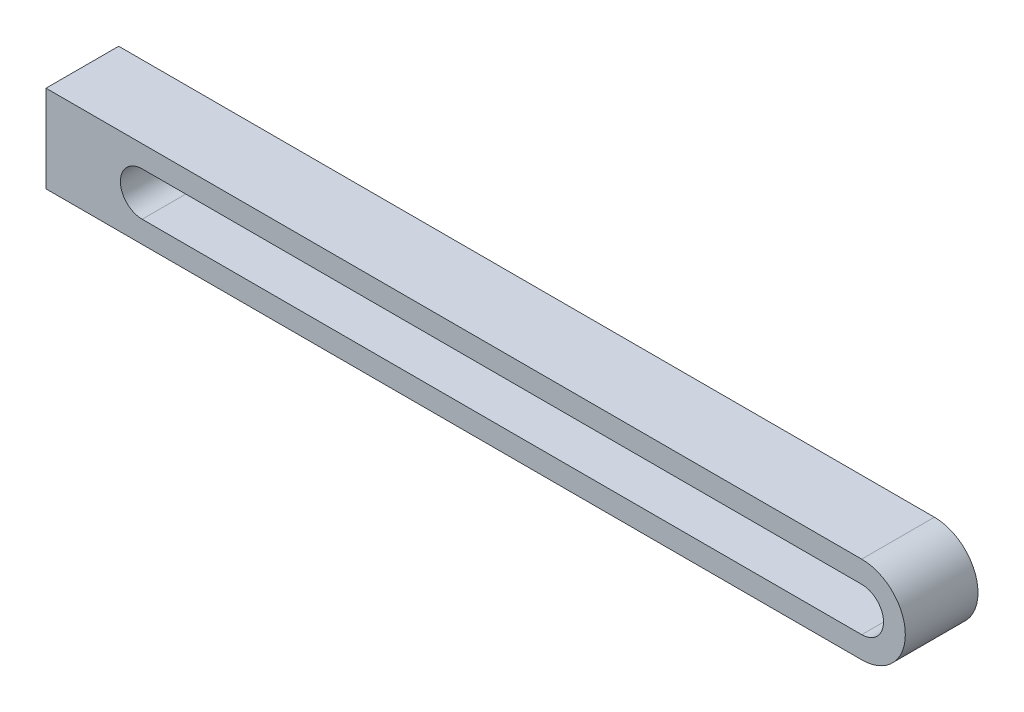
ISO-10303-21;
HEADER;
FILE_DESCRIPTION(('STEP AP214'),'2;1');
FILE_NAME('part.step','',(''),(''),'','','');
FILE_SCHEMA(('AUTOMOTIVE_DESIGN { 1 0 10303 214 1 1 1 1 }'));
ENDSEC;
DATA;
#1=APPLICATION_CONTEXT('core data for automotive mechanical design processes');
#2=APPLICATION_PROTOCOL_DEFINITION('international standard','automotive_design',2000,#1);
#3=PRODUCT_CONTEXT('',#1,'mechanical');
#4=PRODUCT('Part','Part','',(#3));
#5=PRODUCT_RELATED_PRODUCT_CATEGORY('part','',(#4));
#6=PRODUCT_DEFINITION_FORMATION('','',#4);
#7=PRODUCT_DEFINITION_CONTEXT('part definition',#1,'design');
#8=PRODUCT_DEFINITION('design','',#6,#7);
#9=PRODUCT_DEFINITION_SHAPE('','',#8);
#10=(LENGTH_UNIT() NAMED_UNIT(*) SI_UNIT(.MILLI.,.METRE.));
#11=(NAMED_UNIT(*) PLANE_ANGLE_UNIT() SI_UNIT($,.RADIAN.));
#12=(NAMED_UNIT(*) SI_UNIT($,.STERADIAN.) SOLID_ANGLE_UNIT());
#13=UNCERTAINTY_MEASURE_WITH_UNIT(LENGTH_MEASURE(1.E-05),#10,'distance_accuracy_value','');
#14=(GEOMETRIC_REPRESENTATION_CONTEXT(3) GLOBAL_UNCERTAINTY_ASSIGNED_CONTEXT((#13)) GLOBAL_UNIT_ASSIGNED_CONTEXT((#10,
#11,#12)) REPRESENTATION_CONTEXT('',''));
#15=CARTESIAN_POINT('',(0.,0.,0.));
#16=DIRECTION('',(0.,0.,1.));
#17=DIRECTION('',(1.,0.,0.));
#18=AXIS2_PLACEMENT_3D('',#15,#16,#17);
#19=CARTESIAN_POINT('',(49.5,0.,5.));
#20=DIRECTION('',(0.,0.,1.));
#21=DIRECTION('',(1.,0.,0.));
#22=AXIS2_PLACEMENT_3D('',#19,#20,#21);
#23=PLANE('',#22);
#24=DIRECTION('',(0.,-1.,0.));
#25=VECTOR('',#24,1.);
#26=CARTESIAN_POINT('',(-6.61682606522009,3.,5.));
#27=LINE('',#26,#25);
#28=CARTESIAN_POINT('',(-6.61682606522009,3.,5.));
#29=VERTEX_POINT('',#28);
#30=CARTESIAN_POINT('',(-6.61682606522009,-3.,5.));
#31=VERTEX_POINT('',#30);
#32=EDGE_CURVE('E159',#29,#31,#27,.T.);
#33=ORIENTED_EDGE('',*,*,#32,.T.);
#34=DIRECTION('',(1.,0.,0.));
#35=VECTOR('',#34,1.);
#36=CARTESIAN_POINT('',(3.,-3.,5.));
#37=LINE('',#36,#35);
#38=CARTESIAN_POINT('',(49.5,-3.,5.));
#39=VERTEX_POINT('',#38);
#40=EDGE_CURVE('E163',#31,#39,#37,.T.);
#41=ORIENTED_EDGE('',*,*,#40,.T.);
#42=CARTESIAN_POINT('',(49.5,0.,5.));
#43=DIRECTION('',(0.,0.,1.));
#44=DIRECTION('',(1.,0.,0.));
#45=AXIS2_PLACEMENT_3D('',#42,#43,#44);
#46=CIRCLE('',#45,3.);
#47=CARTESIAN_POINT('',(49.5,3.,5.));
#48=VERTEX_POINT('',#47);
#49=EDGE_CURVE('E167',#39,#48,#46,.T.);
#50=ORIENTED_EDGE('',*,*,#49,.T.);
#51=DIRECTION('',(-1.,0.,0.));
#52=VECTOR('',#51,1.);
#53=CARTESIAN_POINT('',(0.,3.,5.));
#54=LINE('',#53,#52);
#55=EDGE_CURVE('E170',#48,#29,#54,.T.);
#56=ORIENTED_EDGE('',*,*,#55,.T.);
#57=EDGE_LOOP('',(#33,#41,#50,#56));
#58=FACE_BOUND('',#57,.T.);
#59=DIRECTION('',(1.,0.,0.));
#60=VECTOR('',#59,1.);
#61=CARTESIAN_POINT('',(0.,-1.5,5.));
#62=LINE('',#61,#60);
#63=CARTESIAN_POINT('',(0.,-1.5,5.));
#64=VERTEX_POINT('',#63);
#65=CARTESIAN_POINT('',(49.5,-1.5,5.));
#66=VERTEX_POINT('',#65);
#67=EDGE_CURVE('E120',#64,#66,#62,.T.);
#68=ORIENTED_EDGE('',*,*,#67,.F.);
#69=CARTESIAN_POINT('',(0.,0.,5.));
#70=DIRECTION('',(0.,0.,1.));
#71=DIRECTION('',(1.,0.,0.));
#72=AXIS2_PLACEMENT_3D('',#69,#70,#71);
#73=CIRCLE('',#72,1.5);
#74=CARTESIAN_POINT('',(0.,1.5,5.));
#75=VERTEX_POINT('',#74);
#76=EDGE_CURVE('E111',#75,#64,#73,.T.);
#77=ORIENTED_EDGE('',*,*,#76,.F.);
#78=DIRECTION('',(-1.,0.,0.));
#79=VECTOR('',#78,1.);
#80=CARTESIAN_POINT('',(49.5,1.5,5.));
#81=LINE('',#80,#79);
#82=CARTESIAN_POINT('',(49.5,1.5,5.));
#83=VERTEX_POINT('',#82);
#84=EDGE_CURVE('E137',#83,#75,#81,.T.);
#85=ORIENTED_EDGE('',*,*,#84,.F.);
#86=CARTESIAN_POINT('',(49.5,0.,5.));
#87=DIRECTION('',(0.,0.,1.));
#88=DIRECTION('',(1.,0.,0.));
#89=AXIS2_PLACEMENT_3D('',#86,#87,#88);
#90=CIRCLE('',#89,1.5);
#91=EDGE_CURVE('E133',#66,#83,#90,.T.);
#92=ORIENTED_EDGE('',*,*,#91,.F.);
#93=EDGE_LOOP('',(#68,#77,#85,#92));
#94=FACE_BOUND('',#93,.T.);
#95=ADVANCED_FACE('F45',(#58,#94),#23,.T.);
#96=CARTESIAN_POINT('',(49.5,0.,0.));
#97=DIRECTION('',(0.,0.,1.));
#98=DIRECTION('',(1.,0.,0.));
#99=AXIS2_PLACEMENT_3D('',#96,#97,#98);
#100=PLANE('',#99);
#101=DIRECTION('',(0.,-1.,0.));
#102=VECTOR('',#101,1.);
#103=CARTESIAN_POINT('',(-6.61682606522009,3.,0.));
#104=LINE('',#103,#102);
#105=CARTESIAN_POINT('',(-6.61682606522009,3.,0.));
#106=VERTEX_POINT('',#105);
#107=CARTESIAN_POINT('',(-6.61682606522009,-3.,0.));
#108=VERTEX_POINT('',#107);
#109=EDGE_CURVE('E129',#106,#108,#104,.T.);
#110=ORIENTED_EDGE('',*,*,#109,.F.);
#111=DIRECTION('',(-1.,0.,0.));
#112=VECTOR('',#111,1.);
#113=CARTESIAN_POINT('',(0.,3.,0.));
#114=LINE('',#113,#112);
#115=CARTESIAN_POINT('',(49.5,3.,0.));
#116=VERTEX_POINT('',#115);
#117=EDGE_CURVE('E164',#116,#106,#114,.T.);
#118=ORIENTED_EDGE('',*,*,#117,.F.);
#119=CARTESIAN_POINT('',(49.5,0.,0.));
#120=DIRECTION('',(0.,0.,1.));
#121=DIRECTION('',(1.,0.,0.));
#122=AXIS2_PLACEMENT_3D('',#119,#120,#121);
#123=CIRCLE('',#122,3.);
#124=CARTESIAN_POINT('',(49.5,-3.,0.));
#125=VERTEX_POINT('',#124);
#126=EDGE_CURVE('E180',#125,#116,#123,.T.);
#127=ORIENTED_EDGE('',*,*,#126,.F.);
#128=DIRECTION('',(1.,0.,0.));
#129=VECTOR('',#128,1.);
#130=CARTESIAN_POINT('',(49.5,-3.,0.));
#131=LINE('',#130,#129);
#132=EDGE_CURVE('E177',#108,#125,#131,.T.);
#133=ORIENTED_EDGE('',*,*,#132,.F.);
#134=EDGE_LOOP('',(#110,#118,#127,#133));
#135=FACE_BOUND('',#134,.T.);
#136=CARTESIAN_POINT('',(0.,0.,0.));
#137=DIRECTION('',(0.,0.,1.));
#138=DIRECTION('',(1.,0.,0.));
#139=AXIS2_PLACEMENT_3D('',#136,#137,#138);
#140=CIRCLE('',#139,1.5);
#141=CARTESIAN_POINT('',(0.,1.5,0.));
#142=VERTEX_POINT('',#141);
#143=CARTESIAN_POINT('',(0.,-1.5,0.));
#144=VERTEX_POINT('',#143);
#145=EDGE_CURVE('E69',#142,#144,#140,.T.);
#146=ORIENTED_EDGE('',*,*,#145,.T.);
#147=DIRECTION('',(1.,0.,0.));
#148=VECTOR('',#147,1.);
#149=CARTESIAN_POINT('',(0.,-1.5,0.));
#150=LINE('',#149,#148);
#151=CARTESIAN_POINT('',(49.5,-1.5,0.));
#152=VERTEX_POINT('',#151);
#153=EDGE_CURVE('E127',#144,#152,#150,.T.);
#154=ORIENTED_EDGE('',*,*,#153,.T.);
#155=CARTESIAN_POINT('',(49.5,0.,0.));
#156=DIRECTION('',(0.,0.,1.));
#157=DIRECTION('',(1.,0.,0.));
#158=AXIS2_PLACEMENT_3D('',#155,#156,#157);
#159=CIRCLE('',#158,1.5);
#160=CARTESIAN_POINT('',(49.5,1.5,0.));
#161=VERTEX_POINT('',#160);
#162=EDGE_CURVE('E146',#152,#161,#159,.T.);
#163=ORIENTED_EDGE('',*,*,#162,.T.);
#164=DIRECTION('',(-1.,0.,0.));
#165=VECTOR('',#164,1.);
#166=CARTESIAN_POINT('',(49.5,1.5,0.));
#167=LINE('',#166,#165);
#168=EDGE_CURVE('E121',#161,#142,#167,.T.);
#169=ORIENTED_EDGE('',*,*,#168,.T.);
#170=EDGE_LOOP('',(#146,#154,#163,#169));
#171=FACE_BOUND('',#170,.T.);
#172=ADVANCED_FACE('F203',(#135,#171),#100,.F.);
#173=CARTESIAN_POINT('',(-6.61682606522009,3.,5.));
#174=DIRECTION('',(1.,0.,0.));
#175=DIRECTION('',(0.,1.,0.));
#176=AXIS2_PLACEMENT_3D('',#173,#174,#175);
#177=PLANE('',#176);
#178=ORIENTED_EDGE('',*,*,#109,.T.);
#179=DIRECTION('',(0.,0.,-1.));
#180=VECTOR('',#179,1.);
#181=CARTESIAN_POINT('',(-6.61682606522009,-3.,5.));
#182=LINE('',#181,#180);
#183=EDGE_CURVE('E11',#31,#108,#182,.T.);
#184=ORIENTED_EDGE('',*,*,#183,.F.);
#185=ORIENTED_EDGE('',*,*,#32,.F.);
#186=DIRECTION('',(0.,0.,-1.));
#187=VECTOR('',#186,1.);
#188=CARTESIAN_POINT('',(-6.61682606522009,3.,5.));
#189=LINE('',#188,#187);
#190=EDGE_CURVE('E173',#29,#106,#189,.T.);
#191=ORIENTED_EDGE('',*,*,#190,.T.);
#192=EDGE_LOOP('',(#178,#184,#185,#191));
#193=FACE_BOUND('',#192,.T.);
#194=ADVANCED_FACE('F47',(#193),#177,.F.);
#195=CARTESIAN_POINT('',(49.5,-3.,5.));
#196=DIRECTION('',(0.,1.,0.));
#197=DIRECTION('',(0.,0.,1.));
#198=AXIS2_PLACEMENT_3D('',#195,#196,#197);
#199=PLANE('',#198);
#200=ORIENTED_EDGE('',*,*,#132,.T.);
#201=DIRECTION('',(0.,0.,-1.));
#202=VECTOR('',#201,1.);
#203=CARTESIAN_POINT('',(49.5,-3.,5.));
#204=LINE('',#203,#202);
#205=EDGE_CURVE('E54',#39,#125,#204,.T.);
#206=ORIENTED_EDGE('',*,*,#205,.F.);
#207=ORIENTED_EDGE('',*,*,#40,.F.);
#208=ORIENTED_EDGE('',*,*,#183,.T.);
#209=EDGE_LOOP('',(#200,#206,#207,#208));
#210=FACE_BOUND('',#209,.T.);
#211=ADVANCED_FACE('F213',(#210),#199,.F.);
#212=CARTESIAN_POINT('',(49.5,0.,5.));
#213=DIRECTION('',(0.,0.,-1.));
#214=DIRECTION('',(-1.,0.,0.));
#215=AXIS2_PLACEMENT_3D('',#212,#213,#214);
#216=CYLINDRICAL_SURFACE('',#215,3.);
#217=ORIENTED_EDGE('',*,*,#126,.T.);
#218=DIRECTION('',(0.,0.,-1.));
#219=VECTOR('',#218,1.);
#220=CARTESIAN_POINT('',(49.5,3.,5.));
#221=LINE('',#220,#219);
#222=EDGE_CURVE('E189',#48,#116,#221,.T.);
#223=ORIENTED_EDGE('',*,*,#222,.F.);
#224=ORIENTED_EDGE('',*,*,#49,.F.);
#225=ORIENTED_EDGE('',*,*,#205,.T.);
#226=EDGE_LOOP('',(#217,#223,#224,#225));
#227=FACE_BOUND('',#226,.T.);
#228=ADVANCED_FACE('F198',(#227),#216,.T.);
#229=CARTESIAN_POINT('',(0.,3.,5.));
#230=DIRECTION('',(0.,-1.,0.));
#231=DIRECTION('',(1.,0.,0.));
#232=AXIS2_PLACEMENT_3D('',#229,#230,#231);
#233=PLANE('',#232);
#234=ORIENTED_EDGE('',*,*,#117,.T.);
#235=ORIENTED_EDGE('',*,*,#190,.F.);
#236=ORIENTED_EDGE('',*,*,#55,.F.);
#237=ORIENTED_EDGE('',*,*,#222,.T.);
#238=EDGE_LOOP('',(#234,#235,#236,#237));
#239=FACE_BOUND('',#238,.T.);
#240=ADVANCED_FACE('F207',(#239),#233,.F.);
#241=CARTESIAN_POINT('',(0.,0.,5.));
#242=DIRECTION('',(0.,0.,-1.));
#243=DIRECTION('',(-1.,0.,0.));
#244=AXIS2_PLACEMENT_3D('',#241,#242,#243);
#245=CYLINDRICAL_SURFACE('',#244,1.5);
#246=ORIENTED_EDGE('',*,*,#145,.F.);
#247=DIRECTION('',(0.,0.,-1.));
#248=VECTOR('',#247,1.);
#249=CARTESIAN_POINT('',(0.,1.5,5.));
#250=LINE('',#249,#248);
#251=EDGE_CURVE('E115',#75,#142,#250,.T.);
#252=ORIENTED_EDGE('',*,*,#251,.F.);
#253=ORIENTED_EDGE('',*,*,#76,.T.);
#254=DIRECTION('',(0.,0.,-1.));
#255=VECTOR('',#254,1.);
#256=CARTESIAN_POINT('',(0.,-1.5,5.));
#257=LINE('',#256,#255);
#258=EDGE_CURVE('E114',#64,#144,#257,.T.);
#259=ORIENTED_EDGE('',*,*,#258,.T.);
#260=EDGE_LOOP('',(#246,#252,#253,#259));
#261=FACE_BOUND('',#260,.T.);
#262=ADVANCED_FACE('F113',(#261),#245,.F.);
#263=CARTESIAN_POINT('',(0.,-1.5,5.));
#264=DIRECTION('',(0.,1.,0.));
#265=DIRECTION('',(-1.,0.,0.));
#266=AXIS2_PLACEMENT_3D('',#263,#264,#265);
#267=PLANE('',#266);
#268=ORIENTED_EDGE('',*,*,#153,.F.);
#269=ORIENTED_EDGE('',*,*,#258,.F.);
#270=ORIENTED_EDGE('',*,*,#67,.T.);
#271=DIRECTION('',(0.,0.,-1.));
#272=VECTOR('',#271,1.);
#273=CARTESIAN_POINT('',(49.5,-1.5,5.));
#274=LINE('',#273,#272);
#275=EDGE_CURVE('E130',#66,#152,#274,.T.);
#276=ORIENTED_EDGE('',*,*,#275,.T.);
#277=EDGE_LOOP('',(#268,#269,#270,#276));
#278=FACE_BOUND('',#277,.T.);
#279=ADVANCED_FACE('F124',(#278),#267,.T.);
#280=CARTESIAN_POINT('',(49.5,0.,5.));
#281=DIRECTION('',(0.,0.,-1.));
#282=DIRECTION('',(-1.,0.,0.));
#283=AXIS2_PLACEMENT_3D('',#280,#281,#282);
#284=CYLINDRICAL_SURFACE('',#283,1.5);
#285=ORIENTED_EDGE('',*,*,#162,.F.);
#286=ORIENTED_EDGE('',*,*,#275,.F.);
#287=ORIENTED_EDGE('',*,*,#91,.T.);
#288=DIRECTION('',(0.,0.,-1.));
#289=VECTOR('',#288,1.);
#290=CARTESIAN_POINT('',(49.5,1.5,5.));
#291=LINE('',#290,#289);
#292=EDGE_CURVE('E61',#83,#161,#291,.T.);
#293=ORIENTED_EDGE('',*,*,#292,.T.);
#294=EDGE_LOOP('',(#285,#286,#287,#293));
#295=FACE_BOUND('',#294,.T.);
#296=ADVANCED_FACE('F236',(#295),#284,.F.);
#297=CARTESIAN_POINT('',(49.5,1.5,5.));
#298=DIRECTION('',(0.,-1.,0.));
#299=DIRECTION('',(1.,0.,0.));
#300=AXIS2_PLACEMENT_3D('',#297,#298,#299);
#301=PLANE('',#300);
#302=ORIENTED_EDGE('',*,*,#168,.F.);
#303=ORIENTED_EDGE('',*,*,#292,.F.);
#304=ORIENTED_EDGE('',*,*,#84,.T.);
#305=ORIENTED_EDGE('',*,*,#251,.T.);
#306=EDGE_LOOP('',(#302,#303,#304,#305));
#307=FACE_BOUND('',#306,.T.);
#308=ADVANCED_FACE('F240',(#307),#301,.T.);
#309=CLOSED_SHELL('',(#95,#172,#194,#211,#228,#240,#262,#279,#296,#308));
#310=MANIFOLD_SOLID_BREP('B2',#309);
#311=ADVANCED_BREP_SHAPE_REPRESENTATION('',(#18,#310),#14);
#312=SHAPE_DEFINITION_REPRESENTATION(#9,#311);
ENDSEC;
END-ISO-10303-21;
